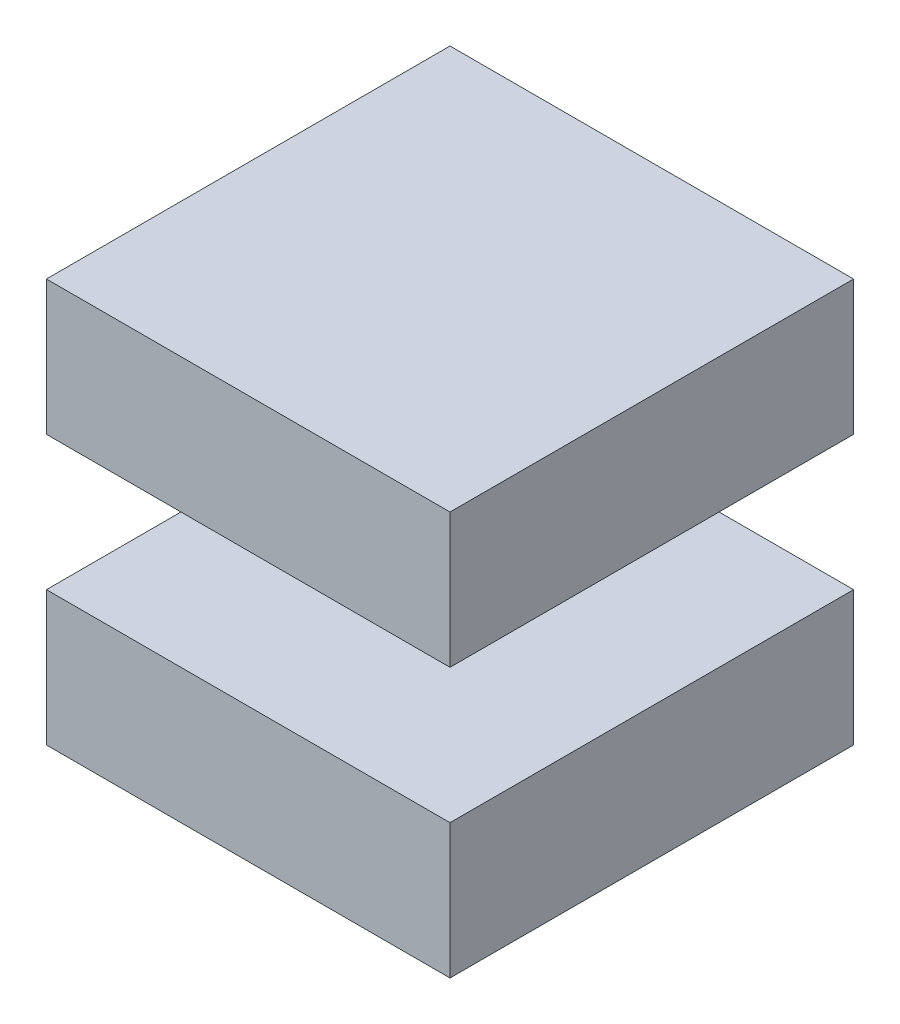
ISO-10303-21;
HEADER;
FILE_DESCRIPTION(('STEP AP214'),'2;1');
FILE_NAME('part.step','',(''),(''),'','','');
FILE_SCHEMA(('AUTOMOTIVE_DESIGN { 1 0 10303 214 1 1 1 1 }'));
ENDSEC;
DATA;
#1=APPLICATION_CONTEXT('core data for automotive mechanical design processes');
#2=APPLICATION_PROTOCOL_DEFINITION('international standard','automotive_design',2000,#1);
#3=PRODUCT_CONTEXT('',#1,'mechanical');
#4=PRODUCT('Part','Part','',(#3));
#5=PRODUCT_RELATED_PRODUCT_CATEGORY('part','',(#4));
#6=PRODUCT_DEFINITION_FORMATION('','',#4);
#7=PRODUCT_DEFINITION_CONTEXT('part definition',#1,'design');
#8=PRODUCT_DEFINITION('design','',#6,#7);
#9=PRODUCT_DEFINITION_SHAPE('','',#8);
#10=(LENGTH_UNIT() NAMED_UNIT(*) SI_UNIT(.MILLI.,.METRE.));
#11=(NAMED_UNIT(*) PLANE_ANGLE_UNIT() SI_UNIT($,.RADIAN.));
#12=(NAMED_UNIT(*) SI_UNIT($,.STERADIAN.) SOLID_ANGLE_UNIT());
#13=UNCERTAINTY_MEASURE_WITH_UNIT(LENGTH_MEASURE(1.E-05),#10,'distance_accuracy_value','');
#14=(GEOMETRIC_REPRESENTATION_CONTEXT(3) GLOBAL_UNCERTAINTY_ASSIGNED_CONTEXT((#13)) GLOBAL_UNIT_ASSIGNED_CONTEXT((#10,
#11,#12)) REPRESENTATION_CONTEXT('',''));
#15=CARTESIAN_POINT('',(0.,0.,0.));
#16=DIRECTION('',(0.,0.,1.));
#17=DIRECTION('',(1.,0.,0.));
#18=AXIS2_PLACEMENT_3D('',#15,#16,#17);
#19=CARTESIAN_POINT('',(20.,40.,0.));
#20=DIRECTION('',(1.,0.,0.));
#21=DIRECTION('',(0.,0.,-1.));
#22=AXIS2_PLACEMENT_3D('',#19,#20,#21);
#23=PLANE('',#22);
#24=DIRECTION('',(0.,0.,-1.));
#25=VECTOR('',#24,1.);
#26=CARTESIAN_POINT('',(20.,20.,20.));
#27=LINE('',#26,#25);
#28=CARTESIAN_POINT('',(20.,20.,40.));
#29=VERTEX_POINT('',#28);
#30=CARTESIAN_POINT('',(20.,20.,20.));
#31=VERTEX_POINT('',#30);
#32=EDGE_CURVE('E395',#29,#31,#27,.T.);
#33=ORIENTED_EDGE('',*,*,#32,.F.);
#34=DIRECTION('',(0.,-1.,0.));
#35=VECTOR('',#34,1.);
#36=CARTESIAN_POINT('',(20.,20.,40.));
#37=LINE('',#36,#35);
#38=CARTESIAN_POINT('',(20.,40.,40.));
#39=VERTEX_POINT('',#38);
#40=EDGE_CURVE('E141',#39,#29,#37,.T.);
#41=ORIENTED_EDGE('',*,*,#40,.F.);
#42=DIRECTION('',(0.,0.,1.));
#43=VECTOR('',#42,1.);
#44=CARTESIAN_POINT('',(20.,40.,40.));
#45=LINE('',#44,#43);
#46=CARTESIAN_POINT('',(20.,40.,20.));
#47=VERTEX_POINT('',#46);
#48=EDGE_CURVE('E394',#47,#39,#45,.T.);
#49=ORIENTED_EDGE('',*,*,#48,.F.);
#50=DIRECTION('',(0.,1.,0.));
#51=VECTOR('',#50,1.);
#52=CARTESIAN_POINT('',(20.,20.,20.));
#53=LINE('',#52,#51);
#54=EDGE_CURVE('E384',#31,#47,#53,.T.);
#55=ORIENTED_EDGE('',*,*,#54,.F.);
#56=EDGE_LOOP('',(#33,#41,#49,#55));
#57=FACE_BOUND('',#56,.T.);
#58=ADVANCED_FACE('F33',(#57),#23,.F.);
#59=CARTESIAN_POINT('',(0.,0.,60.));
#60=DIRECTION('',(0.,0.,-1.));
#61=DIRECTION('',(-1.,0.,0.));
#62=AXIS2_PLACEMENT_3D('',#59,#60,#61);
#63=PLANE('',#62);
#64=DIRECTION('',(-1.,0.,0.));
#65=VECTOR('',#64,1.);
#66=CARTESIAN_POINT('',(0.,40.,60.));
#67=LINE('',#66,#65);
#68=CARTESIAN_POINT('',(60.,40.,60.));
#69=VERTEX_POINT('',#68);
#70=CARTESIAN_POINT('',(0.,40.,60.));
#71=VERTEX_POINT('',#70);
#72=EDGE_CURVE('E172',#69,#71,#67,.T.);
#73=ORIENTED_EDGE('',*,*,#72,.F.);
#74=DIRECTION('',(0.,1.,0.));
#75=VECTOR('',#74,1.);
#76=CARTESIAN_POINT('',(60.,0.,60.));
#77=LINE('',#76,#75);
#78=CARTESIAN_POINT('',(60.,60.,60.));
#79=VERTEX_POINT('',#78);
#80=EDGE_CURVE('E187',#69,#79,#77,.T.);
#81=ORIENTED_EDGE('',*,*,#80,.T.);
#82=DIRECTION('',(-1.,0.,0.));
#83=VECTOR('',#82,1.);
#84=CARTESIAN_POINT('',(0.,60.,60.));
#85=LINE('',#84,#83);
#86=CARTESIAN_POINT('',(0.,60.,60.));
#87=VERTEX_POINT('',#86);
#88=EDGE_CURVE('E50',#79,#87,#85,.T.);
#89=ORIENTED_EDGE('',*,*,#88,.T.);
#90=DIRECTION('',(0.,-1.,0.));
#91=VECTOR('',#90,1.);
#92=CARTESIAN_POINT('',(0.,0.,60.));
#93=LINE('',#92,#91);
#94=EDGE_CURVE('E183',#87,#71,#93,.T.);
#95=ORIENTED_EDGE('',*,*,#94,.T.);
#96=EDGE_LOOP('',(#73,#81,#89,#95));
#97=FACE_BOUND('',#96,.T.);
#98=ADVANCED_FACE('F230',(#97),#63,.F.);
#99=CARTESIAN_POINT('',(0.,0.,0.));
#100=DIRECTION('',(0.,0.,-1.));
#101=DIRECTION('',(-1.,0.,0.));
#102=AXIS2_PLACEMENT_3D('',#99,#100,#101);
#103=PLANE('',#102);
#104=DIRECTION('',(1.,0.,0.));
#105=VECTOR('',#104,1.);
#106=CARTESIAN_POINT('',(0.,20.,0.));
#107=LINE('',#106,#105);
#108=CARTESIAN_POINT('',(0.,20.,0.));
#109=VERTEX_POINT('',#108);
#110=CARTESIAN_POINT('',(60.,20.,0.));
#111=VERTEX_POINT('',#110);
#112=EDGE_CURVE('E169',#109,#111,#107,.T.);
#113=ORIENTED_EDGE('',*,*,#112,.T.);
#114=DIRECTION('',(0.,1.,0.));
#115=VECTOR('',#114,1.);
#116=CARTESIAN_POINT('',(60.,0.,0.));
#117=LINE('',#116,#115);
#118=CARTESIAN_POINT('',(60.,0.,0.));
#119=VERTEX_POINT('',#118);
#120=EDGE_CURVE('E196',#119,#111,#117,.T.);
#121=ORIENTED_EDGE('',*,*,#120,.F.);
#122=DIRECTION('',(1.,0.,0.));
#123=VECTOR('',#122,1.);
#124=CARTESIAN_POINT('',(0.,0.,0.));
#125=LINE('',#124,#123);
#126=CARTESIAN_POINT('',(0.,0.,0.));
#127=VERTEX_POINT('',#126);
#128=EDGE_CURVE('E194',#127,#119,#125,.T.);
#129=ORIENTED_EDGE('',*,*,#128,.F.);
#130=DIRECTION('',(0.,-1.,0.));
#131=VECTOR('',#130,1.);
#132=CARTESIAN_POINT('',(0.,0.,0.));
#133=LINE('',#132,#131);
#134=EDGE_CURVE('E181',#109,#127,#133,.T.);
#135=ORIENTED_EDGE('',*,*,#134,.F.);
#136=EDGE_LOOP('',(#113,#121,#129,#135));
#137=FACE_BOUND('',#136,.T.);
#138=ADVANCED_FACE('F212',(#137),#103,.T.);
#139=CARTESIAN_POINT('',(60.,0.,60.));
#140=DIRECTION('',(-1.,0.,0.));
#141=DIRECTION('',(0.,0.,1.));
#142=AXIS2_PLACEMENT_3D('',#139,#140,#141);
#143=PLANE('',#142);
#144=ORIENTED_EDGE('',*,*,#120,.T.);
#145=DIRECTION('',(0.,0.,1.));
#146=VECTOR('',#145,1.);
#147=CARTESIAN_POINT('',(60.,20.,0.));
#148=LINE('',#147,#146);
#149=CARTESIAN_POINT('',(60.,20.,60.));
#150=VERTEX_POINT('',#149);
#151=EDGE_CURVE('E158',#111,#150,#148,.T.);
#152=ORIENTED_EDGE('',*,*,#151,.T.);
#153=CARTESIAN_POINT('',(60.,0.,60.));
#154=VERTEX_POINT('',#153);
#155=EDGE_CURVE('E188',#154,#150,#77,.T.);
#156=ORIENTED_EDGE('',*,*,#155,.F.);
#157=DIRECTION('',(0.,0.,-1.));
#158=VECTOR('',#157,1.);
#159=CARTESIAN_POINT('',(60.,0.,60.));
#160=LINE('',#159,#158);
#161=EDGE_CURVE('E42',#154,#119,#160,.T.);
#162=ORIENTED_EDGE('',*,*,#161,.T.);
#163=EDGE_LOOP('',(#144,#152,#156,#162));
#164=FACE_BOUND('',#163,.T.);
#165=ADVANCED_FACE('F208',(#164),#143,.F.);
#166=CARTESIAN_POINT('',(0.,0.,60.));
#167=DIRECTION('',(1.,0.,0.));
#168=DIRECTION('',(0.,0.,-1.));
#169=AXIS2_PLACEMENT_3D('',#166,#167,#168);
#170=PLANE('',#169);
#171=DIRECTION('',(0.,0.,1.));
#172=VECTOR('',#171,1.);
#173=CARTESIAN_POINT('',(0.,40.,0.));
#174=LINE('',#173,#172);
#175=CARTESIAN_POINT('',(0.,40.,0.));
#176=VERTEX_POINT('',#175);
#177=EDGE_CURVE('E179',#176,#71,#174,.T.);
#178=ORIENTED_EDGE('',*,*,#177,.T.);
#179=ORIENTED_EDGE('',*,*,#94,.F.);
#180=DIRECTION('',(0.,0.,-1.));
#181=VECTOR('',#180,1.);
#182=CARTESIAN_POINT('',(0.,60.,60.));
#183=LINE('',#182,#181);
#184=CARTESIAN_POINT('',(0.,60.,0.));
#185=VERTEX_POINT('',#184);
#186=EDGE_CURVE('E74',#87,#185,#183,.T.);
#187=ORIENTED_EDGE('',*,*,#186,.T.);
#188=EDGE_CURVE('E192',#185,#176,#133,.T.);
#189=ORIENTED_EDGE('',*,*,#188,.T.);
#190=EDGE_LOOP('',(#178,#179,#187,#189));
#191=FACE_BOUND('',#190,.T.);
#192=ADVANCED_FACE('F223',(#191),#170,.F.);
#193=CARTESIAN_POINT('',(0.,20.,60.));
#194=VERTEX_POINT('',#193);
#195=CARTESIAN_POINT('',(0.,0.,60.));
#196=VERTEX_POINT('',#195);
#197=EDGE_CURVE('E82',#194,#196,#93,.T.);
#198=ORIENTED_EDGE('',*,*,#197,.F.);
#199=DIRECTION('',(0.,0.,1.));
#200=VECTOR('',#199,1.);
#201=CARTESIAN_POINT('',(0.,20.,0.));
#202=LINE('',#201,#200);
#203=EDGE_CURVE('E175',#109,#194,#202,.T.);
#204=ORIENTED_EDGE('',*,*,#203,.F.);
#205=ORIENTED_EDGE('',*,*,#134,.T.);
#206=DIRECTION('',(0.,0.,-1.));
#207=VECTOR('',#206,1.);
#208=CARTESIAN_POINT('',(0.,0.,60.));
#209=LINE('',#208,#207);
#210=EDGE_CURVE('E11',#196,#127,#209,.T.);
#211=ORIENTED_EDGE('',*,*,#210,.F.);
#212=EDGE_LOOP('',(#198,#204,#205,#211));
#213=FACE_BOUND('',#212,.T.);
#214=ADVANCED_FACE('F35',(#213),#170,.F.);
#215=CARTESIAN_POINT('',(0.,0.,60.));
#216=DIRECTION('',(0.,1.,0.));
#217=DIRECTION('',(0.,0.,1.));
#218=AXIS2_PLACEMENT_3D('',#215,#216,#217);
#219=PLANE('',#218);
#220=ORIENTED_EDGE('',*,*,#210,.T.);
#221=ORIENTED_EDGE('',*,*,#128,.T.);
#222=ORIENTED_EDGE('',*,*,#161,.F.);
#223=DIRECTION('',(1.,0.,0.));
#224=VECTOR('',#223,1.);
#225=CARTESIAN_POINT('',(0.,0.,60.));
#226=LINE('',#225,#224);
#227=EDGE_CURVE('E185',#196,#154,#226,.T.);
#228=ORIENTED_EDGE('',*,*,#227,.F.);
#229=EDGE_LOOP('',(#220,#221,#222,#228));
#230=FACE_BOUND('',#229,.T.);
#231=ADVANCED_FACE('F220',(#230),#219,.F.);
#232=ORIENTED_EDGE('',*,*,#80,.F.);
#233=DIRECTION('',(0.,0.,1.));
#234=VECTOR('',#233,1.);
#235=CARTESIAN_POINT('',(60.,40.,0.));
#236=LINE('',#235,#234);
#237=CARTESIAN_POINT('',(60.,40.,0.));
#238=VERTEX_POINT('',#237);
#239=EDGE_CURVE('E163',#238,#69,#236,.T.);
#240=ORIENTED_EDGE('',*,*,#239,.F.);
#241=CARTESIAN_POINT('',(60.,60.,0.));
#242=VERTEX_POINT('',#241);
#243=EDGE_CURVE('E67',#238,#242,#117,.T.);
#244=ORIENTED_EDGE('',*,*,#243,.T.);
#245=DIRECTION('',(0.,0.,-1.));
#246=VECTOR('',#245,1.);
#247=CARTESIAN_POINT('',(60.,60.,60.));
#248=LINE('',#247,#246);
#249=EDGE_CURVE('E202',#79,#242,#248,.T.);
#250=ORIENTED_EDGE('',*,*,#249,.F.);
#251=EDGE_LOOP('',(#232,#240,#244,#250));
#252=FACE_BOUND('',#251,.T.);
#253=ADVANCED_FACE('F228',(#252),#143,.F.);
#254=CARTESIAN_POINT('',(0.,60.,60.));
#255=DIRECTION('',(0.,-1.,0.));
#256=DIRECTION('',(0.,0.,-1.));
#257=AXIS2_PLACEMENT_3D('',#254,#255,#256);
#258=PLANE('',#257);
#259=DIRECTION('',(-1.,0.,0.));
#260=VECTOR('',#259,1.);
#261=CARTESIAN_POINT('',(0.,60.,0.));
#262=LINE('',#261,#260);
#263=EDGE_CURVE('E199',#242,#185,#262,.T.);
#264=ORIENTED_EDGE('',*,*,#263,.T.);
#265=ORIENTED_EDGE('',*,*,#186,.F.);
#266=ORIENTED_EDGE('',*,*,#88,.F.);
#267=ORIENTED_EDGE('',*,*,#249,.T.);
#268=EDGE_LOOP('',(#264,#265,#266,#267));
#269=FACE_BOUND('',#268,.T.);
#270=ADVANCED_FACE('F245',(#269),#258,.F.);
#271=ORIENTED_EDGE('',*,*,#155,.T.);
#272=DIRECTION('',(1.,0.,0.));
#273=VECTOR('',#272,1.);
#274=CARTESIAN_POINT('',(0.,20.,60.));
#275=LINE('',#274,#273);
#276=EDGE_CURVE('E161',#194,#150,#275,.T.);
#277=ORIENTED_EDGE('',*,*,#276,.F.);
#278=ORIENTED_EDGE('',*,*,#197,.T.);
#279=ORIENTED_EDGE('',*,*,#227,.T.);
#280=EDGE_LOOP('',(#271,#277,#278,#279));
#281=FACE_BOUND('',#280,.T.);
#282=ADVANCED_FACE('F218',(#281),#63,.F.);
#283=ORIENTED_EDGE('',*,*,#243,.F.);
#284=DIRECTION('',(-1.,0.,0.));
#285=VECTOR('',#284,1.);
#286=CARTESIAN_POINT('',(0.,40.,0.));
#287=LINE('',#286,#285);
#288=EDGE_CURVE('E171',#238,#176,#287,.T.);
#289=ORIENTED_EDGE('',*,*,#288,.T.);
#290=ORIENTED_EDGE('',*,*,#188,.F.);
#291=ORIENTED_EDGE('',*,*,#263,.F.);
#292=EDGE_LOOP('',(#283,#289,#290,#291));
#293=FACE_BOUND('',#292,.T.);
#294=ADVANCED_FACE('F244',(#293),#103,.T.);
#295=CARTESIAN_POINT('',(0.,40.,0.));
#296=DIRECTION('',(0.,1.,0.));
#297=DIRECTION('',(0.,0.,1.));
#298=AXIS2_PLACEMENT_3D('',#295,#296,#297);
#299=PLANE('',#298);
#300=ORIENTED_EDGE('',*,*,#72,.T.);
#301=ORIENTED_EDGE('',*,*,#177,.F.);
#302=ORIENTED_EDGE('',*,*,#288,.F.);
#303=ORIENTED_EDGE('',*,*,#239,.T.);
#304=EDGE_LOOP('',(#300,#301,#302,#303));
#305=FACE_BOUND('',#304,.T.);
#306=ORIENTED_EDGE('',*,*,#48,.T.);
#307=DIRECTION('',(-1.,0.,0.));
#308=VECTOR('',#307,1.);
#309=CARTESIAN_POINT('',(40.,40.,40.));
#310=LINE('',#309,#308);
#311=CARTESIAN_POINT('',(40.,40.,40.));
#312=VERTEX_POINT('',#311);
#313=EDGE_CURVE('E145',#312,#39,#310,.T.);
#314=ORIENTED_EDGE('',*,*,#313,.F.);
#315=DIRECTION('',(0.,0.,1.));
#316=VECTOR('',#315,1.);
#317=CARTESIAN_POINT('',(40.,40.,0.));
#318=LINE('',#317,#316);
#319=CARTESIAN_POINT('',(40.,40.,20.));
#320=VERTEX_POINT('',#319);
#321=EDGE_CURVE('E153',#320,#312,#318,.T.);
#322=ORIENTED_EDGE('',*,*,#321,.F.);
#323=DIRECTION('',(-1.,0.,0.));
#324=VECTOR('',#323,1.);
#325=CARTESIAN_POINT('',(40.,40.,20.));
#326=LINE('',#325,#324);
#327=EDGE_CURVE('E386',#320,#47,#326,.T.);
#328=ORIENTED_EDGE('',*,*,#327,.T.);
#329=EDGE_LOOP('',(#306,#314,#322,#328));
#330=FACE_BOUND('',#329,.T.);
#331=ADVANCED_FACE('F239',(#305,#330),#299,.F.);
#332=CARTESIAN_POINT('',(0.,20.,0.));
#333=DIRECTION('',(0.,-1.,0.));
#334=DIRECTION('',(1.,0.,0.));
#335=AXIS2_PLACEMENT_3D('',#332,#333,#334);
#336=PLANE('',#335);
#337=ORIENTED_EDGE('',*,*,#203,.T.);
#338=ORIENTED_EDGE('',*,*,#276,.T.);
#339=ORIENTED_EDGE('',*,*,#151,.F.);
#340=ORIENTED_EDGE('',*,*,#112,.F.);
#341=EDGE_LOOP('',(#337,#338,#339,#340));
#342=FACE_BOUND('',#341,.T.);
#343=ORIENTED_EDGE('',*,*,#32,.T.);
#344=DIRECTION('',(-1.,0.,0.));
#345=VECTOR('',#344,1.);
#346=CARTESIAN_POINT('',(40.,20.,20.));
#347=LINE('',#346,#345);
#348=CARTESIAN_POINT('',(40.,20.,20.));
#349=VERTEX_POINT('',#348);
#350=EDGE_CURVE('E156',#349,#31,#347,.T.);
#351=ORIENTED_EDGE('',*,*,#350,.F.);
#352=DIRECTION('',(0.,0.,1.));
#353=VECTOR('',#352,1.);
#354=CARTESIAN_POINT('',(40.,20.,0.));
#355=LINE('',#354,#353);
#356=CARTESIAN_POINT('',(40.,20.,40.));
#357=VERTEX_POINT('',#356);
#358=EDGE_CURVE('E151',#349,#357,#355,.T.);
#359=ORIENTED_EDGE('',*,*,#358,.T.);
#360=DIRECTION('',(-1.,0.,0.));
#361=VECTOR('',#360,1.);
#362=CARTESIAN_POINT('',(40.,20.,40.));
#363=LINE('',#362,#361);
#364=EDGE_CURVE('E135',#357,#29,#363,.T.);
#365=ORIENTED_EDGE('',*,*,#364,.T.);
#366=EDGE_LOOP('',(#343,#351,#359,#365));
#367=FACE_BOUND('',#366,.T.);
#368=ADVANCED_FACE('F155',(#342,#367),#336,.F.);
#369=CARTESIAN_POINT('',(40.,40.,0.));
#370=DIRECTION('',(-1.,0.,0.));
#371=DIRECTION('',(0.,0.,1.));
#372=AXIS2_PLACEMENT_3D('',#369,#370,#371);
#373=PLANE('',#372);
#374=ORIENTED_EDGE('',*,*,#321,.T.);
#375=DIRECTION('',(0.,-1.,0.));
#376=VECTOR('',#375,1.);
#377=CARTESIAN_POINT('',(40.,20.,40.));
#378=LINE('',#377,#376);
#379=EDGE_CURVE('E138',#312,#357,#378,.T.);
#380=ORIENTED_EDGE('',*,*,#379,.T.);
#381=ORIENTED_EDGE('',*,*,#358,.F.);
#382=DIRECTION('',(0.,1.,0.));
#383=VECTOR('',#382,1.);
#384=CARTESIAN_POINT('',(40.,20.,20.));
#385=LINE('',#384,#383);
#386=EDGE_CURVE('E387',#349,#320,#385,.T.);
#387=ORIENTED_EDGE('',*,*,#386,.T.);
#388=EDGE_LOOP('',(#374,#380,#381,#387));
#389=FACE_BOUND('',#388,.T.);
#390=ADVANCED_FACE('F149',(#389),#373,.F.);
#391=CARTESIAN_POINT('',(40.,20.,20.));
#392=DIRECTION('',(0.,0.,1.));
#393=DIRECTION('',(1.,0.,0.));
#394=AXIS2_PLACEMENT_3D('',#391,#392,#393);
#395=PLANE('',#394);
#396=ORIENTED_EDGE('',*,*,#54,.T.);
#397=ORIENTED_EDGE('',*,*,#327,.F.);
#398=ORIENTED_EDGE('',*,*,#386,.F.);
#399=ORIENTED_EDGE('',*,*,#350,.T.);
#400=EDGE_LOOP('',(#396,#397,#398,#399));
#401=FACE_BOUND('',#400,.T.);
#402=ADVANCED_FACE('F307',(#401),#395,.F.);
#403=CARTESIAN_POINT('',(40.,20.,40.));
#404=DIRECTION('',(0.,0.,-1.));
#405=DIRECTION('',(-1.,0.,0.));
#406=AXIS2_PLACEMENT_3D('',#403,#404,#405);
#407=PLANE('',#406);
#408=ORIENTED_EDGE('',*,*,#40,.T.);
#409=ORIENTED_EDGE('',*,*,#364,.F.);
#410=ORIENTED_EDGE('',*,*,#379,.F.);
#411=ORIENTED_EDGE('',*,*,#313,.T.);
#412=EDGE_LOOP('',(#408,#409,#410,#411));
#413=FACE_BOUND('',#412,.T.);
#414=ADVANCED_FACE('F137',(#413),#407,.F.);
#415=CLOSED_SHELL('',(#58,#98,#138,#165,#192,#214,#231,#253,#270,#282,#294,#331,#368,#390,#402,#414));
#416=MANIFOLD_SOLID_BREP('B2',#415);
#417=ADVANCED_BREP_SHAPE_REPRESENTATION('',(#18,#416),#14);
#418=SHAPE_DEFINITION_REPRESENTATION(#9,#417);
ENDSEC;
END-ISO-10303-21;
